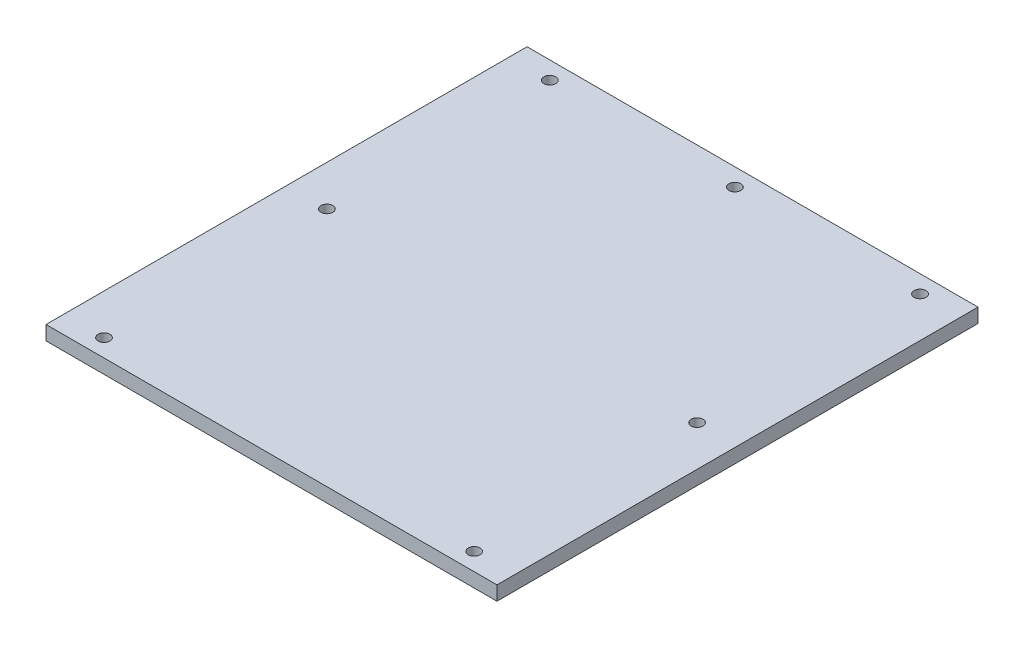
ISO-10303-21;
HEADER;
FILE_DESCRIPTION(('STEP AP214'),'2;1');
FILE_NAME('part.step','',(''),(''),'','','');
FILE_SCHEMA(('AUTOMOTIVE_DESIGN { 1 0 10303 214 1 1 1 1 }'));
ENDSEC;
DATA;
#1=APPLICATION_CONTEXT('core data for automotive mechanical design processes');
#2=APPLICATION_PROTOCOL_DEFINITION('international standard','automotive_design',2000,#1);
#3=PRODUCT_CONTEXT('',#1,'mechanical');
#4=PRODUCT('Part','Part','',(#3));
#5=PRODUCT_RELATED_PRODUCT_CATEGORY('part','',(#4));
#6=PRODUCT_DEFINITION_FORMATION('','',#4);
#7=PRODUCT_DEFINITION_CONTEXT('part definition',#1,'design');
#8=PRODUCT_DEFINITION('design','',#6,#7);
#9=PRODUCT_DEFINITION_SHAPE('','',#8);
#10=(LENGTH_UNIT() NAMED_UNIT(*) SI_UNIT(.MILLI.,.METRE.));
#11=(NAMED_UNIT(*) PLANE_ANGLE_UNIT() SI_UNIT($,.RADIAN.));
#12=(NAMED_UNIT(*) SI_UNIT($,.STERADIAN.) SOLID_ANGLE_UNIT());
#13=UNCERTAINTY_MEASURE_WITH_UNIT(LENGTH_MEASURE(1.E-05),#10,'distance_accuracy_value','');
#14=(GEOMETRIC_REPRESENTATION_CONTEXT(3) GLOBAL_UNCERTAINTY_ASSIGNED_CONTEXT((#13)) GLOBAL_UNIT_ASSIGNED_CONTEXT((#10,
#11,#12)) REPRESENTATION_CONTEXT('',''));
#15=CARTESIAN_POINT('',(0.,0.,0.));
#16=DIRECTION('',(0.,0.,1.));
#17=DIRECTION('',(1.,0.,0.));
#18=AXIS2_PLACEMENT_3D('',#15,#16,#17);
#19=CARTESIAN_POINT('',(0.,6.,0.));
#20=DIRECTION('',(0.,1.,0.));
#21=DIRECTION('',(0.,0.,1.));
#22=AXIS2_PLACEMENT_3D('',#19,#20,#21);
#23=PLANE('',#22);
#24=CARTESIAN_POINT('',(78.1870361579999,6.,94.1650737980001));
#25=DIRECTION('',(0.,1.,0.));
#26=DIRECTION('',(0.,0.,1.));
#27=AXIS2_PLACEMENT_3D('',#24,#25,#26);
#28=CIRCLE('',#27,2.5);
#29=CARTESIAN_POINT('',(78.1870361579999,6.,96.6650737980001));
#30=VERTEX_POINT('',#29);
#31=EDGE_CURVE('E123',#30,#30,#28,.T.);
#32=ORIENTED_EDGE('',*,*,#31,.F.);
#33=EDGE_LOOP('',(#32));
#34=FACE_BOUND('',#33,.T.);
#35=CARTESIAN_POINT('',(78.187036158,6.,-94.165073798));
#36=DIRECTION('',(0.,-1.,0.));
#37=DIRECTION('',(0.,0.,-1.));
#38=AXIS2_PLACEMENT_3D('',#35,#36,#37);
#39=CIRCLE('',#38,2.5);
#40=CARTESIAN_POINT('',(78.187036158,6.,-96.6650737980001));
#41=VERTEX_POINT('',#40);
#42=EDGE_CURVE('E147',#41,#41,#39,.T.);
#43=ORIENTED_EDGE('',*,*,#42,.T.);
#44=EDGE_LOOP('',(#43));
#45=FACE_BOUND('',#44,.T.);
#46=CARTESIAN_POINT('',(0.,6.,-94.165073798));
#47=DIRECTION('',(0.,1.,0.));
#48=DIRECTION('',(0.,0.,1.));
#49=AXIS2_PLACEMENT_3D('',#46,#47,#48);
#50=CIRCLE('',#49,2.5);
#51=CARTESIAN_POINT('',(0.,6.,-91.665073798));
#52=VERTEX_POINT('',#51);
#53=EDGE_CURVE('E117',#52,#52,#50,.T.);
#54=ORIENTED_EDGE('',*,*,#53,.F.);
#55=EDGE_LOOP('',(#54));
#56=FACE_BOUND('',#55,.T.);
#57=CARTESIAN_POINT('',(-78.187036158,6.,-94.165073798));
#58=DIRECTION('',(0.,1.,0.));
#59=DIRECTION('',(0.,0.,1.));
#60=AXIS2_PLACEMENT_3D('',#57,#58,#59);
#61=CIRCLE('',#60,2.5);
#62=CARTESIAN_POINT('',(-78.187036158,6.,-91.665073798));
#63=VERTEX_POINT('',#62);
#64=EDGE_CURVE('E114',#63,#63,#61,.T.);
#65=ORIENTED_EDGE('',*,*,#64,.F.);
#66=EDGE_LOOP('',(#65));
#67=FACE_BOUND('',#66,.T.);
#68=DIRECTION('',(0.,0.,-1.));
#69=VECTOR('',#68,1.);
#70=CARTESIAN_POINT('',(95.25,6.,-101.6));
#71=LINE('',#70,#69);
#72=CARTESIAN_POINT('',(95.25,6.,101.6));
#73=VERTEX_POINT('',#72);
#74=CARTESIAN_POINT('',(95.25,6.,-101.6));
#75=VERTEX_POINT('',#74);
#76=EDGE_CURVE('E87',#73,#75,#71,.T.);
#77=ORIENTED_EDGE('',*,*,#76,.T.);
#78=DIRECTION('',(-1.,0.,0.));
#79=VECTOR('',#78,1.);
#80=CARTESIAN_POINT('',(-95.25,6.,-101.6));
#81=LINE('',#80,#79);
#82=CARTESIAN_POINT('',(-95.25,6.,-101.6));
#83=VERTEX_POINT('',#82);
#84=EDGE_CURVE('E82',#75,#83,#81,.T.);
#85=ORIENTED_EDGE('',*,*,#84,.T.);
#86=DIRECTION('',(0.,0.,1.));
#87=VECTOR('',#86,1.);
#88=CARTESIAN_POINT('',(-95.25,6.,-101.6));
#89=LINE('',#88,#87);
#90=CARTESIAN_POINT('',(-95.25,6.,101.6));
#91=VERTEX_POINT('',#90);
#92=EDGE_CURVE('E85',#83,#91,#89,.T.);
#93=ORIENTED_EDGE('',*,*,#92,.T.);
#94=DIRECTION('',(1.,0.,0.));
#95=VECTOR('',#94,1.);
#96=CARTESIAN_POINT('',(-95.25,6.,101.6));
#97=LINE('',#96,#95);
#98=EDGE_CURVE('E52',#91,#73,#97,.T.);
#99=ORIENTED_EDGE('',*,*,#98,.T.);
#100=EDGE_LOOP('',(#77,#85,#93,#99));
#101=FACE_BOUND('',#100,.T.);
#102=CARTESIAN_POINT('',(-78.187036158,6.,0.));
#103=DIRECTION('',(0.,1.,0.));
#104=DIRECTION('',(0.,0.,1.));
#105=AXIS2_PLACEMENT_3D('',#102,#103,#104);
#106=CIRCLE('',#105,2.50000000000001);
#107=CARTESIAN_POINT('',(-78.187036158,6.,2.5));
#108=VERTEX_POINT('',#107);
#109=EDGE_CURVE('E141',#108,#108,#106,.T.);
#110=ORIENTED_EDGE('',*,*,#109,.F.);
#111=EDGE_LOOP('',(#110));
#112=FACE_BOUND('',#111,.T.);
#113=CARTESIAN_POINT('',(78.1870361579999,6.,0.));
#114=DIRECTION('',(0.,1.,0.));
#115=DIRECTION('',(0.,0.,1.));
#116=AXIS2_PLACEMENT_3D('',#113,#114,#115);
#117=CIRCLE('',#116,2.50000000000001);
#118=CARTESIAN_POINT('',(78.1870361579999,6.,2.5));
#119=VERTEX_POINT('',#118);
#120=EDGE_CURVE('E135',#119,#119,#117,.T.);
#121=ORIENTED_EDGE('',*,*,#120,.F.);
#122=EDGE_LOOP('',(#121));
#123=FACE_BOUND('',#122,.T.);
#124=CARTESIAN_POINT('',(-78.1870361580001,6.,94.165073798));
#125=DIRECTION('',(0.,-1.,0.));
#126=DIRECTION('',(0.,0.,-1.));
#127=AXIS2_PLACEMENT_3D('',#124,#125,#126);
#128=CIRCLE('',#127,2.5);
#129=CARTESIAN_POINT('',(-78.1870361580001,6.,91.665073798));
#130=VERTEX_POINT('',#129);
#131=EDGE_CURVE('E129',#130,#130,#128,.T.);
#132=ORIENTED_EDGE('',*,*,#131,.T.);
#133=EDGE_LOOP('',(#132));
#134=FACE_BOUND('',#133,.T.);
#135=ADVANCED_FACE('F35',(#34,#45,#56,#67,#101,#112,#123,#134),#23,.T.);
#136=CARTESIAN_POINT('',(0.,0.,0.));
#137=DIRECTION('',(0.,1.,0.));
#138=DIRECTION('',(0.,0.,1.));
#139=AXIS2_PLACEMENT_3D('',#136,#137,#138);
#140=PLANE('',#139);
#141=CARTESIAN_POINT('',(78.1870361579999,0.,94.1650737980001));
#142=DIRECTION('',(0.,1.,0.));
#143=DIRECTION('',(0.,0.,1.));
#144=AXIS2_PLACEMENT_3D('',#141,#142,#143);
#145=CIRCLE('',#144,2.5);
#146=CARTESIAN_POINT('',(78.1870361579999,0.,96.6650737980001));
#147=VERTEX_POINT('',#146);
#148=EDGE_CURVE('E120',#147,#147,#145,.T.);
#149=ORIENTED_EDGE('',*,*,#148,.T.);
#150=EDGE_LOOP('',(#149));
#151=FACE_BOUND('',#150,.T.);
#152=CARTESIAN_POINT('',(78.1870361579999,0.,0.));
#153=DIRECTION('',(0.,1.,0.));
#154=DIRECTION('',(0.,0.,1.));
#155=AXIS2_PLACEMENT_3D('',#152,#153,#154);
#156=CIRCLE('',#155,2.50000000000001);
#157=CARTESIAN_POINT('',(78.1870361579999,0.,2.5));
#158=VERTEX_POINT('',#157);
#159=EDGE_CURVE('E132',#158,#158,#156,.T.);
#160=ORIENTED_EDGE('',*,*,#159,.T.);
#161=EDGE_LOOP('',(#160));
#162=FACE_BOUND('',#161,.T.);
#163=CARTESIAN_POINT('',(-78.187036158,0.,0.));
#164=DIRECTION('',(0.,1.,0.));
#165=DIRECTION('',(0.,0.,1.));
#166=AXIS2_PLACEMENT_3D('',#163,#164,#165);
#167=CIRCLE('',#166,2.50000000000001);
#168=CARTESIAN_POINT('',(-78.187036158,0.,2.5));
#169=VERTEX_POINT('',#168);
#170=EDGE_CURVE('E138',#169,#169,#167,.T.);
#171=ORIENTED_EDGE('',*,*,#170,.T.);
#172=EDGE_LOOP('',(#171));
#173=FACE_BOUND('',#172,.T.);
#174=CARTESIAN_POINT('',(0.,0.,-94.165073798));
#175=DIRECTION('',(0.,1.,0.));
#176=DIRECTION('',(0.,0.,1.));
#177=AXIS2_PLACEMENT_3D('',#174,#175,#176);
#178=CIRCLE('',#177,2.5);
#179=CARTESIAN_POINT('',(0.,0.,-91.665073798));
#180=VERTEX_POINT('',#179);
#181=EDGE_CURVE('E150',#180,#180,#178,.T.);
#182=ORIENTED_EDGE('',*,*,#181,.T.);
#183=EDGE_LOOP('',(#182));
#184=FACE_BOUND('',#183,.T.);
#185=CARTESIAN_POINT('',(-78.187036158,0.,-94.165073798));
#186=DIRECTION('',(0.,1.,0.));
#187=DIRECTION('',(0.,0.,1.));
#188=AXIS2_PLACEMENT_3D('',#185,#186,#187);
#189=CIRCLE('',#188,2.5);
#190=CARTESIAN_POINT('',(-78.187036158,0.,-91.665073798));
#191=VERTEX_POINT('',#190);
#192=EDGE_CURVE('E102',#191,#191,#189,.T.);
#193=ORIENTED_EDGE('',*,*,#192,.T.);
#194=EDGE_LOOP('',(#193));
#195=FACE_BOUND('',#194,.T.);
#196=DIRECTION('',(0.,0.,-1.));
#197=VECTOR('',#196,1.);
#198=CARTESIAN_POINT('',(95.25,0.,-101.6));
#199=LINE('',#198,#197);
#200=CARTESIAN_POINT('',(95.25,0.,101.6));
#201=VERTEX_POINT('',#200);
#202=CARTESIAN_POINT('',(95.25,0.,-101.6));
#203=VERTEX_POINT('',#202);
#204=EDGE_CURVE('E99',#201,#203,#199,.T.);
#205=ORIENTED_EDGE('',*,*,#204,.F.);
#206=DIRECTION('',(1.,0.,0.));
#207=VECTOR('',#206,1.);
#208=CARTESIAN_POINT('',(-95.25,0.,101.6));
#209=LINE('',#208,#207);
#210=CARTESIAN_POINT('',(-95.25,0.,101.6));
#211=VERTEX_POINT('',#210);
#212=EDGE_CURVE('E75',#211,#201,#209,.T.);
#213=ORIENTED_EDGE('',*,*,#212,.F.);
#214=DIRECTION('',(0.,0.,1.));
#215=VECTOR('',#214,1.);
#216=CARTESIAN_POINT('',(-95.25,0.,-101.6));
#217=LINE('',#216,#215);
#218=CARTESIAN_POINT('',(-95.25,0.,-101.6));
#219=VERTEX_POINT('',#218);
#220=EDGE_CURVE('E69',#219,#211,#217,.T.);
#221=ORIENTED_EDGE('',*,*,#220,.F.);
#222=DIRECTION('',(-1.,0.,0.));
#223=VECTOR('',#222,1.);
#224=CARTESIAN_POINT('',(-95.25,0.,-101.6));
#225=LINE('',#224,#223);
#226=EDGE_CURVE('E91',#203,#219,#225,.T.);
#227=ORIENTED_EDGE('',*,*,#226,.F.);
#228=EDGE_LOOP('',(#205,#213,#221,#227));
#229=FACE_BOUND('',#228,.T.);
#230=CARTESIAN_POINT('',(78.187036158,0.,-94.165073798));
#231=DIRECTION('',(0.,-1.,0.));
#232=DIRECTION('',(0.,0.,-1.));
#233=AXIS2_PLACEMENT_3D('',#230,#231,#232);
#234=CIRCLE('',#233,2.5);
#235=CARTESIAN_POINT('',(78.187036158,0.,-96.6650737980001));
#236=VERTEX_POINT('',#235);
#237=EDGE_CURVE('E144',#236,#236,#234,.T.);
#238=ORIENTED_EDGE('',*,*,#237,.F.);
#239=EDGE_LOOP('',(#238));
#240=FACE_BOUND('',#239,.T.);
#241=CARTESIAN_POINT('',(-78.1870361580001,0.,94.165073798));
#242=DIRECTION('',(0.,-1.,0.));
#243=DIRECTION('',(0.,0.,-1.));
#244=AXIS2_PLACEMENT_3D('',#241,#242,#243);
#245=CIRCLE('',#244,2.5);
#246=CARTESIAN_POINT('',(-78.1870361580001,0.,91.665073798));
#247=VERTEX_POINT('',#246);
#248=EDGE_CURVE('E126',#247,#247,#245,.T.);
#249=ORIENTED_EDGE('',*,*,#248,.F.);
#250=EDGE_LOOP('',(#249));
#251=FACE_BOUND('',#250,.T.);
#252=ADVANCED_FACE('F110',(#151,#162,#173,#184,#195,#229,#240,#251),#140,.F.);
#253=CARTESIAN_POINT('',(95.25,6.,-101.6));
#254=DIRECTION('',(-1.,0.,0.));
#255=DIRECTION('',(0.,0.,1.));
#256=AXIS2_PLACEMENT_3D('',#253,#254,#255);
#257=PLANE('',#256);
#258=ORIENTED_EDGE('',*,*,#204,.T.);
#259=DIRECTION('',(0.,-1.,0.));
#260=VECTOR('',#259,1.);
#261=CARTESIAN_POINT('',(95.25,6.,-101.6));
#262=LINE('',#261,#260);
#263=EDGE_CURVE('E11',#75,#203,#262,.T.);
#264=ORIENTED_EDGE('',*,*,#263,.F.);
#265=ORIENTED_EDGE('',*,*,#76,.F.);
#266=DIRECTION('',(0.,-1.,0.));
#267=VECTOR('',#266,1.);
#268=CARTESIAN_POINT('',(95.25,6.,101.6));
#269=LINE('',#268,#267);
#270=EDGE_CURVE('E95',#73,#201,#269,.T.);
#271=ORIENTED_EDGE('',*,*,#270,.T.);
#272=EDGE_LOOP('',(#258,#264,#265,#271));
#273=FACE_BOUND('',#272,.T.);
#274=ADVANCED_FACE('F37',(#273),#257,.F.);
#275=CARTESIAN_POINT('',(-95.25,6.,-101.6));
#276=DIRECTION('',(0.,0.,1.));
#277=DIRECTION('',(1.,0.,0.));
#278=AXIS2_PLACEMENT_3D('',#275,#276,#277);
#279=PLANE('',#278);
#280=ORIENTED_EDGE('',*,*,#226,.T.);
#281=DIRECTION('',(0.,-1.,0.));
#282=VECTOR('',#281,1.);
#283=CARTESIAN_POINT('',(-95.25,6.,-101.6));
#284=LINE('',#283,#282);
#285=EDGE_CURVE('E44',#83,#219,#284,.T.);
#286=ORIENTED_EDGE('',*,*,#285,.F.);
#287=ORIENTED_EDGE('',*,*,#84,.F.);
#288=ORIENTED_EDGE('',*,*,#263,.T.);
#289=EDGE_LOOP('',(#280,#286,#287,#288));
#290=FACE_BOUND('',#289,.T.);
#291=ADVANCED_FACE('F90',(#290),#279,.F.);
#292=CARTESIAN_POINT('',(-95.25,6.,-101.6));
#293=DIRECTION('',(1.,0.,0.));
#294=DIRECTION('',(0.,0.,-1.));
#295=AXIS2_PLACEMENT_3D('',#292,#293,#294);
#296=PLANE('',#295);
#297=ORIENTED_EDGE('',*,*,#220,.T.);
#298=DIRECTION('',(0.,-1.,0.));
#299=VECTOR('',#298,1.);
#300=CARTESIAN_POINT('',(-95.25,6.,101.6));
#301=LINE('',#300,#299);
#302=EDGE_CURVE('E92',#91,#211,#301,.T.);
#303=ORIENTED_EDGE('',*,*,#302,.F.);
#304=ORIENTED_EDGE('',*,*,#92,.F.);
#305=ORIENTED_EDGE('',*,*,#285,.T.);
#306=EDGE_LOOP('',(#297,#303,#304,#305));
#307=FACE_BOUND('',#306,.T.);
#308=ADVANCED_FACE('F93',(#307),#296,.F.);
#309=CARTESIAN_POINT('',(-95.25,6.,101.6));
#310=DIRECTION('',(0.,0.,-1.));
#311=DIRECTION('',(-1.,0.,0.));
#312=AXIS2_PLACEMENT_3D('',#309,#310,#311);
#313=PLANE('',#312);
#314=ORIENTED_EDGE('',*,*,#212,.T.);
#315=ORIENTED_EDGE('',*,*,#270,.F.);
#316=ORIENTED_EDGE('',*,*,#98,.F.);
#317=ORIENTED_EDGE('',*,*,#302,.T.);
#318=EDGE_LOOP('',(#314,#315,#316,#317));
#319=FACE_BOUND('',#318,.T.);
#320=ADVANCED_FACE('F107',(#319),#313,.F.);
#321=CARTESIAN_POINT('',(-78.187036158,0.,-94.165073798));
#322=DIRECTION('',(0.,1.,0.));
#323=DIRECTION('',(0.,0.,1.));
#324=AXIS2_PLACEMENT_3D('',#321,#322,#323);
#325=CYLINDRICAL_SURFACE('',#324,2.5);
#326=ORIENTED_EDGE('',*,*,#192,.F.);
#327=EDGE_LOOP('',(#326));
#328=FACE_BOUND('',#327,.T.);
#329=ORIENTED_EDGE('',*,*,#64,.T.);
#330=EDGE_LOOP('',(#329));
#331=FACE_BOUND('',#330,.T.);
#332=ADVANCED_FACE('F164',(#328,#331),#325,.F.);
#333=CARTESIAN_POINT('',(0.,0.,-94.165073798));
#334=DIRECTION('',(0.,1.,0.));
#335=DIRECTION('',(0.,0.,1.));
#336=AXIS2_PLACEMENT_3D('',#333,#334,#335);
#337=CYLINDRICAL_SURFACE('',#336,2.5);
#338=ORIENTED_EDGE('',*,*,#181,.F.);
#339=EDGE_LOOP('',(#338));
#340=FACE_BOUND('',#339,.T.);
#341=ORIENTED_EDGE('',*,*,#53,.T.);
#342=EDGE_LOOP('',(#341));
#343=FACE_BOUND('',#342,.T.);
#344=ADVANCED_FACE('F156',(#340,#343),#337,.F.);
#345=CARTESIAN_POINT('',(78.187036158,0.,-94.165073798));
#346=DIRECTION('',(0.,1.,0.));
#347=DIRECTION('',(0.,0.,1.));
#348=AXIS2_PLACEMENT_3D('',#345,#346,#347);
#349=CYLINDRICAL_SURFACE('',#348,2.5);
#350=ORIENTED_EDGE('',*,*,#237,.T.);
#351=EDGE_LOOP('',(#350));
#352=FACE_BOUND('',#351,.T.);
#353=ORIENTED_EDGE('',*,*,#42,.F.);
#354=EDGE_LOOP('',(#353));
#355=FACE_BOUND('',#354,.T.);
#356=ADVANCED_FACE('F172',(#352,#355),#349,.F.);
#357=CARTESIAN_POINT('',(-78.187036158,0.,0.));
#358=DIRECTION('',(0.,1.,0.));
#359=DIRECTION('',(0.,0.,1.));
#360=AXIS2_PLACEMENT_3D('',#357,#358,#359);
#361=CYLINDRICAL_SURFACE('',#360,2.50000000000001);
#362=ORIENTED_EDGE('',*,*,#170,.F.);
#363=EDGE_LOOP('',(#362));
#364=FACE_BOUND('',#363,.T.);
#365=ORIENTED_EDGE('',*,*,#109,.T.);
#366=EDGE_LOOP('',(#365));
#367=FACE_BOUND('',#366,.T.);
#368=ADVANCED_FACE('F238',(#364,#367),#361,.F.);
#369=CARTESIAN_POINT('',(78.1870361579999,0.,0.));
#370=DIRECTION('',(0.,1.,0.));
#371=DIRECTION('',(0.,0.,1.));
#372=AXIS2_PLACEMENT_3D('',#369,#370,#371);
#373=CYLINDRICAL_SURFACE('',#372,2.50000000000001);
#374=ORIENTED_EDGE('',*,*,#159,.F.);
#375=EDGE_LOOP('',(#374));
#376=FACE_BOUND('',#375,.T.);
#377=ORIENTED_EDGE('',*,*,#120,.T.);
#378=EDGE_LOOP('',(#377));
#379=FACE_BOUND('',#378,.T.);
#380=ADVANCED_FACE('F247',(#376,#379),#373,.F.);
#381=CARTESIAN_POINT('',(-78.1870361580001,0.,94.165073798));
#382=DIRECTION('',(0.,1.,0.));
#383=DIRECTION('',(0.,0.,1.));
#384=AXIS2_PLACEMENT_3D('',#381,#382,#383);
#385=CYLINDRICAL_SURFACE('',#384,2.5);
#386=ORIENTED_EDGE('',*,*,#248,.T.);
#387=EDGE_LOOP('',(#386));
#388=FACE_BOUND('',#387,.T.);
#389=ORIENTED_EDGE('',*,*,#131,.F.);
#390=EDGE_LOOP('',(#389));
#391=FACE_BOUND('',#390,.T.);
#392=ADVANCED_FACE('F256',(#388,#391),#385,.F.);
#393=CARTESIAN_POINT('',(78.1870361579999,0.,94.1650737980001));
#394=DIRECTION('',(0.,1.,0.));
#395=DIRECTION('',(0.,0.,1.));
#396=AXIS2_PLACEMENT_3D('',#393,#394,#395);
#397=CYLINDRICAL_SURFACE('',#396,2.5);
#398=ORIENTED_EDGE('',*,*,#148,.F.);
#399=EDGE_LOOP('',(#398));
#400=FACE_BOUND('',#399,.T.);
#401=ORIENTED_EDGE('',*,*,#31,.T.);
#402=EDGE_LOOP('',(#401));
#403=FACE_BOUND('',#402,.T.);
#404=ADVANCED_FACE('F178',(#400,#403),#397,.F.);
#405=CLOSED_SHELL('',(#135,#252,#274,#291,#308,#320,#332,#344,#356,#368,#380,#392,#404));
#406=MANIFOLD_SOLID_BREP('B2',#405);
#407=ADVANCED_BREP_SHAPE_REPRESENTATION('',(#18,#406),#14);
#408=SHAPE_DEFINITION_REPRESENTATION(#9,#407);
ENDSEC;
END-ISO-10303-21;
